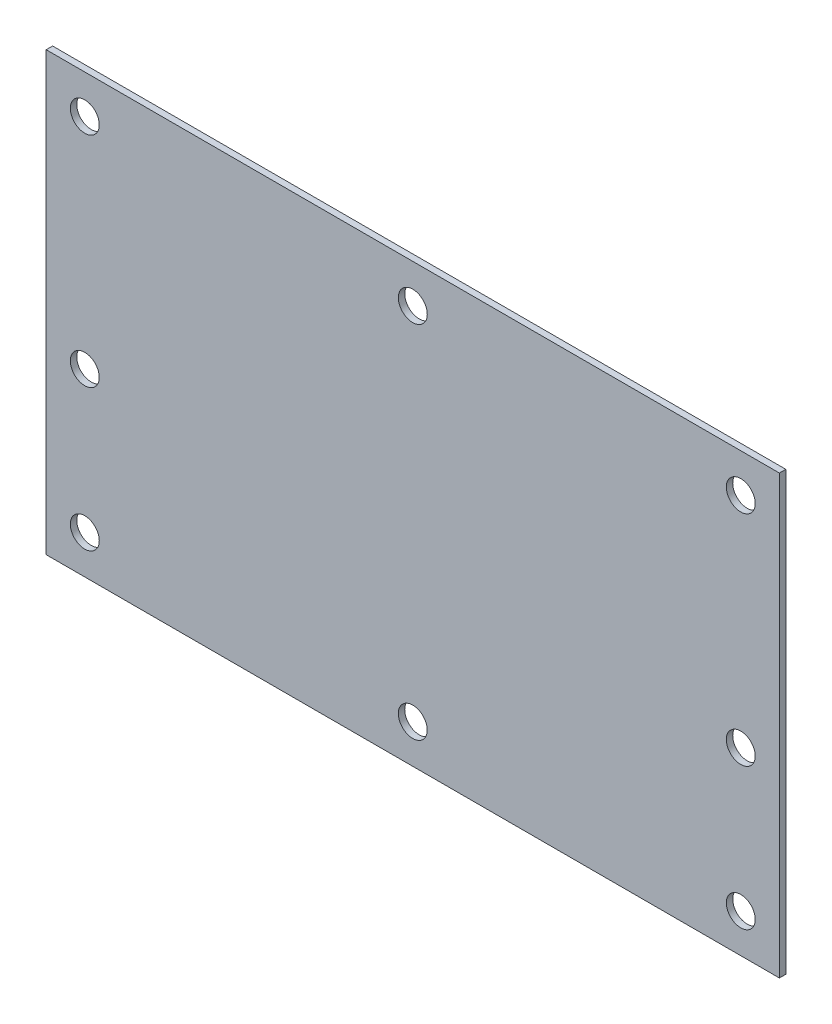
ISO-10303-21;
HEADER;
FILE_DESCRIPTION(('STEP AP214'),'2;1');
FILE_NAME('part.step','',(''),(''),'','','');
FILE_SCHEMA(('AUTOMOTIVE_DESIGN { 1 0 10303 214 1 1 1 1 }'));
ENDSEC;
DATA;
#1=APPLICATION_CONTEXT('core data for automotive mechanical design processes');
#2=APPLICATION_PROTOCOL_DEFINITION('international standard','automotive_design',2000,#1);
#3=PRODUCT_CONTEXT('',#1,'mechanical');
#4=PRODUCT('Part','Part','',(#3));
#5=PRODUCT_RELATED_PRODUCT_CATEGORY('part','',(#4));
#6=PRODUCT_DEFINITION_FORMATION('','',#4);
#7=PRODUCT_DEFINITION_CONTEXT('part definition',#1,'design');
#8=PRODUCT_DEFINITION('design','',#6,#7);
#9=PRODUCT_DEFINITION_SHAPE('','',#8);
#10=(LENGTH_UNIT() NAMED_UNIT(*) SI_UNIT(.MILLI.,.METRE.));
#11=(NAMED_UNIT(*) PLANE_ANGLE_UNIT() SI_UNIT($,.RADIAN.));
#12=(NAMED_UNIT(*) SI_UNIT($,.STERADIAN.) SOLID_ANGLE_UNIT());
#13=UNCERTAINTY_MEASURE_WITH_UNIT(LENGTH_MEASURE(1.E-05),#10,'distance_accuracy_value','');
#14=(GEOMETRIC_REPRESENTATION_CONTEXT(3) GLOBAL_UNCERTAINTY_ASSIGNED_CONTEXT((#13)) GLOBAL_UNIT_ASSIGNED_CONTEXT((#10,
#11,#12)) REPRESENTATION_CONTEXT('',''));
#15=CARTESIAN_POINT('',(0.,0.,0.));
#16=DIRECTION('',(0.,0.,1.));
#17=DIRECTION('',(1.,0.,0.));
#18=AXIS2_PLACEMENT_3D('',#15,#16,#17);
#19=CARTESIAN_POINT('',(0.,0.,1.));
#20=DIRECTION('',(1.,0.,0.));
#21=DIRECTION('',(0.,0.,-1.));
#22=AXIS2_PLACEMENT_3D('',#19,#20,#21);
#23=PLANE('',#22);
#24=DIRECTION('',(0.,-1.,0.));
#25=VECTOR('',#24,1.);
#26=CARTESIAN_POINT('',(0.,0.,0.));
#27=LINE('',#26,#25);
#28=CARTESIAN_POINT('',(0.,68.,0.));
#29=VERTEX_POINT('',#28);
#30=CARTESIAN_POINT('',(0.,0.,0.));
#31=VERTEX_POINT('',#30);
#32=EDGE_CURVE('E98',#29,#31,#27,.T.);
#33=ORIENTED_EDGE('',*,*,#32,.T.);
#34=DIRECTION('',(0.,0.,-1.));
#35=VECTOR('',#34,1.);
#36=CARTESIAN_POINT('',(0.,0.,1.));
#37=LINE('',#36,#35);
#38=CARTESIAN_POINT('',(0.,0.,1.));
#39=VERTEX_POINT('',#38);
#40=EDGE_CURVE('E11',#39,#31,#37,.T.);
#41=ORIENTED_EDGE('',*,*,#40,.F.);
#42=DIRECTION('',(0.,-1.,0.));
#43=VECTOR('',#42,1.);
#44=CARTESIAN_POINT('',(0.,0.,1.));
#45=LINE('',#44,#43);
#46=CARTESIAN_POINT('',(0.,68.,1.));
#47=VERTEX_POINT('',#46);
#48=EDGE_CURVE('E86',#47,#39,#45,.T.);
#49=ORIENTED_EDGE('',*,*,#48,.F.);
#50=DIRECTION('',(0.,0.,-1.));
#51=VECTOR('',#50,1.);
#52=CARTESIAN_POINT('',(0.,68.,1.));
#53=LINE('',#52,#51);
#54=EDGE_CURVE('E94',#47,#29,#53,.T.);
#55=ORIENTED_EDGE('',*,*,#54,.T.);
#56=EDGE_LOOP('',(#33,#41,#49,#55));
#57=FACE_BOUND('',#56,.T.);
#58=ADVANCED_FACE('F35',(#57),#23,.F.);
#59=CARTESIAN_POINT('',(0.,0.,1.));
#60=DIRECTION('',(0.,1.,0.));
#61=DIRECTION('',(0.,0.,1.));
#62=AXIS2_PLACEMENT_3D('',#59,#60,#61);
#63=PLANE('',#62);
#64=DIRECTION('',(1.,0.,0.));
#65=VECTOR('',#64,1.);
#66=CARTESIAN_POINT('',(0.,0.,0.));
#67=LINE('',#66,#65);
#68=CARTESIAN_POINT('',(114.,0.,0.));
#69=VERTEX_POINT('',#68);
#70=EDGE_CURVE('E90',#31,#69,#67,.T.);
#71=ORIENTED_EDGE('',*,*,#70,.T.);
#72=DIRECTION('',(0.,0.,-1.));
#73=VECTOR('',#72,1.);
#74=CARTESIAN_POINT('',(114.,0.,1.));
#75=LINE('',#74,#73);
#76=CARTESIAN_POINT('',(114.,0.,1.));
#77=VERTEX_POINT('',#76);
#78=EDGE_CURVE('E43',#77,#69,#75,.T.);
#79=ORIENTED_EDGE('',*,*,#78,.F.);
#80=DIRECTION('',(1.,0.,0.));
#81=VECTOR('',#80,1.);
#82=CARTESIAN_POINT('',(0.,0.,1.));
#83=LINE('',#82,#81);
#84=EDGE_CURVE('E81',#39,#77,#83,.T.);
#85=ORIENTED_EDGE('',*,*,#84,.F.);
#86=ORIENTED_EDGE('',*,*,#40,.T.);
#87=EDGE_LOOP('',(#71,#79,#85,#86));
#88=FACE_BOUND('',#87,.T.);
#89=ADVANCED_FACE('F89',(#88),#63,.F.);
#90=CARTESIAN_POINT('',(114.,0.,1.));
#91=DIRECTION('',(-1.,0.,0.));
#92=DIRECTION('',(0.,0.,1.));
#93=AXIS2_PLACEMENT_3D('',#90,#91,#92);
#94=PLANE('',#93);
#95=DIRECTION('',(0.,1.,0.));
#96=VECTOR('',#95,1.);
#97=CARTESIAN_POINT('',(114.,0.,0.));
#98=LINE('',#97,#96);
#99=CARTESIAN_POINT('',(114.,68.,0.));
#100=VERTEX_POINT('',#99);
#101=EDGE_CURVE('E68',#69,#100,#98,.T.);
#102=ORIENTED_EDGE('',*,*,#101,.T.);
#103=DIRECTION('',(0.,0.,-1.));
#104=VECTOR('',#103,1.);
#105=CARTESIAN_POINT('',(114.,68.,1.));
#106=LINE('',#105,#104);
#107=CARTESIAN_POINT('',(114.,68.,1.));
#108=VERTEX_POINT('',#107);
#109=EDGE_CURVE('E91',#108,#100,#106,.T.);
#110=ORIENTED_EDGE('',*,*,#109,.F.);
#111=DIRECTION('',(0.,1.,0.));
#112=VECTOR('',#111,1.);
#113=CARTESIAN_POINT('',(114.,0.,1.));
#114=LINE('',#113,#112);
#115=EDGE_CURVE('E84',#77,#108,#114,.T.);
#116=ORIENTED_EDGE('',*,*,#115,.F.);
#117=ORIENTED_EDGE('',*,*,#78,.T.);
#118=EDGE_LOOP('',(#102,#110,#116,#117));
#119=FACE_BOUND('',#118,.T.);
#120=ADVANCED_FACE('F92',(#119),#94,.F.);
#121=CARTESIAN_POINT('',(0.,68.,1.));
#122=DIRECTION('',(0.,-1.,0.));
#123=DIRECTION('',(0.,0.,-1.));
#124=AXIS2_PLACEMENT_3D('',#121,#122,#123);
#125=PLANE('',#124);
#126=DIRECTION('',(-1.,0.,0.));
#127=VECTOR('',#126,1.);
#128=CARTESIAN_POINT('',(0.,68.,0.));
#129=LINE('',#128,#127);
#130=EDGE_CURVE('E74',#100,#29,#129,.T.);
#131=ORIENTED_EDGE('',*,*,#130,.T.);
#132=ORIENTED_EDGE('',*,*,#54,.F.);
#133=DIRECTION('',(-1.,0.,0.));
#134=VECTOR('',#133,1.);
#135=CARTESIAN_POINT('',(0.,68.,1.));
#136=LINE('',#135,#134);
#137=EDGE_CURVE('E51',#108,#47,#136,.T.);
#138=ORIENTED_EDGE('',*,*,#137,.F.);
#139=ORIENTED_EDGE('',*,*,#109,.T.);
#140=EDGE_LOOP('',(#131,#132,#138,#139));
#141=FACE_BOUND('',#140,.T.);
#142=ADVANCED_FACE('F106',(#141),#125,.F.);
#143=CARTESIAN_POINT('',(0.,0.,1.));
#144=DIRECTION('',(0.,0.,-1.));
#145=DIRECTION('',(-1.,0.,0.));
#146=AXIS2_PLACEMENT_3D('',#143,#144,#145);
#147=PLANE('',#146);
#148=CARTESIAN_POINT('',(108.,6.,1.));
#149=DIRECTION('',(0.,0.,1.));
#150=DIRECTION('',(1.,0.,0.));
#151=AXIS2_PLACEMENT_3D('',#148,#149,#150);
#152=CIRCLE('',#151,2.25);
#153=CARTESIAN_POINT('',(110.25,6.,1.));
#154=VERTEX_POINT('',#153);
#155=EDGE_CURVE('E139',#154,#154,#152,.T.);
#156=ORIENTED_EDGE('',*,*,#155,.F.);
#157=EDGE_LOOP('',(#156));
#158=FACE_BOUND('',#157,.T.);
#159=CARTESIAN_POINT('',(108.,28.,1.));
#160=DIRECTION('',(0.,0.,1.));
#161=DIRECTION('',(1.,0.,0.));
#162=AXIS2_PLACEMENT_3D('',#159,#160,#161);
#163=CIRCLE('',#162,2.25);
#164=CARTESIAN_POINT('',(110.25,28.,1.));
#165=VERTEX_POINT('',#164);
#166=EDGE_CURVE('E145',#165,#165,#163,.T.);
#167=ORIENTED_EDGE('',*,*,#166,.F.);
#168=EDGE_LOOP('',(#167));
#169=FACE_BOUND('',#168,.T.);
#170=CARTESIAN_POINT('',(108.,62.,1.));
#171=DIRECTION('',(0.,0.,1.));
#172=DIRECTION('',(1.,0.,0.));
#173=AXIS2_PLACEMENT_3D('',#170,#171,#172);
#174=CIRCLE('',#173,2.24999999999999);
#175=CARTESIAN_POINT('',(110.25,62.,1.));
#176=VERTEX_POINT('',#175);
#177=EDGE_CURVE('E151',#176,#176,#174,.T.);
#178=ORIENTED_EDGE('',*,*,#177,.F.);
#179=EDGE_LOOP('',(#178));
#180=FACE_BOUND('',#179,.T.);
#181=CARTESIAN_POINT('',(57.,62.,1.));
#182=DIRECTION('',(0.,0.,1.));
#183=DIRECTION('',(1.,0.,0.));
#184=AXIS2_PLACEMENT_3D('',#181,#182,#183);
#185=CIRCLE('',#184,2.25);
#186=CARTESIAN_POINT('',(59.25,62.,1.));
#187=VERTEX_POINT('',#186);
#188=EDGE_CURVE('E128',#187,#187,#185,.T.);
#189=ORIENTED_EDGE('',*,*,#188,.F.);
#190=EDGE_LOOP('',(#189));
#191=FACE_BOUND('',#190,.T.);
#192=CARTESIAN_POINT('',(6.00000000000001,6.,1.));
#193=DIRECTION('',(0.,0.,1.));
#194=DIRECTION('',(1.,0.,0.));
#195=AXIS2_PLACEMENT_3D('',#192,#193,#194);
#196=CIRCLE('',#195,2.25);
#197=CARTESIAN_POINT('',(8.25000000000001,6.,1.));
#198=VERTEX_POINT('',#197);
#199=EDGE_CURVE('E115',#198,#198,#196,.T.);
#200=ORIENTED_EDGE('',*,*,#199,.F.);
#201=EDGE_LOOP('',(#200));
#202=FACE_BOUND('',#201,.T.);
#203=CARTESIAN_POINT('',(6.00000000000001,62.,1.));
#204=DIRECTION('',(0.,0.,1.));
#205=DIRECTION('',(1.,0.,0.));
#206=AXIS2_PLACEMENT_3D('',#203,#204,#205);
#207=CIRCLE('',#206,2.25);
#208=CARTESIAN_POINT('',(8.25,62.,1.));
#209=VERTEX_POINT('',#208);
#210=EDGE_CURVE('E121',#209,#209,#207,.T.);
#211=ORIENTED_EDGE('',*,*,#210,.F.);
#212=EDGE_LOOP('',(#211));
#213=FACE_BOUND('',#212,.T.);
#214=CARTESIAN_POINT('',(57.,6.,1.));
#215=DIRECTION('',(0.,0.,1.));
#216=DIRECTION('',(1.,0.,0.));
#217=AXIS2_PLACEMENT_3D('',#214,#215,#216);
#218=CIRCLE('',#217,2.25);
#219=CARTESIAN_POINT('',(59.25,6.,1.));
#220=VERTEX_POINT('',#219);
#221=EDGE_CURVE('E127',#220,#220,#218,.T.);
#222=ORIENTED_EDGE('',*,*,#221,.F.);
#223=EDGE_LOOP('',(#222));
#224=FACE_BOUND('',#223,.T.);
#225=CARTESIAN_POINT('',(6.,28.,1.));
#226=DIRECTION('',(0.,0.,1.));
#227=DIRECTION('',(1.,0.,0.));
#228=AXIS2_PLACEMENT_3D('',#225,#226,#227);
#229=CIRCLE('',#228,2.25);
#230=CARTESIAN_POINT('',(8.25000000000001,28.,1.));
#231=VERTEX_POINT('',#230);
#232=EDGE_CURVE('E101',#231,#231,#229,.T.);
#233=ORIENTED_EDGE('',*,*,#232,.F.);
#234=EDGE_LOOP('',(#233));
#235=FACE_BOUND('',#234,.T.);
#236=ORIENTED_EDGE('',*,*,#48,.T.);
#237=ORIENTED_EDGE('',*,*,#84,.T.);
#238=ORIENTED_EDGE('',*,*,#115,.T.);
#239=ORIENTED_EDGE('',*,*,#137,.T.);
#240=EDGE_LOOP('',(#236,#237,#238,#239));
#241=FACE_BOUND('',#240,.T.);
#242=ADVANCED_FACE('F82',(#158,#169,#180,#191,#202,#213,#224,#235,#241),#147,.F.);
#243=CARTESIAN_POINT('',(0.,0.,0.));
#244=DIRECTION('',(0.,0.,-1.));
#245=DIRECTION('',(-1.,0.,0.));
#246=AXIS2_PLACEMENT_3D('',#243,#244,#245);
#247=PLANE('',#246);
#248=CARTESIAN_POINT('',(108.,6.,0.));
#249=DIRECTION('',(0.,0.,-1.));
#250=DIRECTION('',(-1.,0.,0.));
#251=AXIS2_PLACEMENT_3D('',#248,#249,#250);
#252=CIRCLE('',#251,2.25);
#253=CARTESIAN_POINT('',(105.75,6.,0.));
#254=VERTEX_POINT('',#253);
#255=EDGE_CURVE('E136',#254,#254,#252,.F.);
#256=ORIENTED_EDGE('',*,*,#255,.T.);
#257=EDGE_LOOP('',(#256));
#258=FACE_BOUND('',#257,.T.);
#259=CARTESIAN_POINT('',(108.,28.,0.));
#260=DIRECTION('',(0.,0.,-1.));
#261=DIRECTION('',(-1.,0.,0.));
#262=AXIS2_PLACEMENT_3D('',#259,#260,#261);
#263=CIRCLE('',#262,2.25);
#264=CARTESIAN_POINT('',(105.75,28.,0.));
#265=VERTEX_POINT('',#264);
#266=EDGE_CURVE('E142',#265,#265,#263,.F.);
#267=ORIENTED_EDGE('',*,*,#266,.T.);
#268=EDGE_LOOP('',(#267));
#269=FACE_BOUND('',#268,.T.);
#270=CARTESIAN_POINT('',(108.,62.,0.));
#271=DIRECTION('',(0.,0.,-1.));
#272=DIRECTION('',(-1.,0.,0.));
#273=AXIS2_PLACEMENT_3D('',#270,#271,#272);
#274=CIRCLE('',#273,2.24999999999999);
#275=CARTESIAN_POINT('',(105.75,62.,0.));
#276=VERTEX_POINT('',#275);
#277=EDGE_CURVE('E148',#276,#276,#274,.F.);
#278=ORIENTED_EDGE('',*,*,#277,.T.);
#279=EDGE_LOOP('',(#278));
#280=FACE_BOUND('',#279,.T.);
#281=CARTESIAN_POINT('',(57.,62.,0.));
#282=DIRECTION('',(0.,0.,-1.));
#283=DIRECTION('',(-1.,0.,0.));
#284=AXIS2_PLACEMENT_3D('',#281,#282,#283);
#285=CIRCLE('',#284,2.25);
#286=CARTESIAN_POINT('',(54.75,62.,0.));
#287=VERTEX_POINT('',#286);
#288=EDGE_CURVE('E154',#287,#287,#285,.F.);
#289=ORIENTED_EDGE('',*,*,#288,.T.);
#290=EDGE_LOOP('',(#289));
#291=FACE_BOUND('',#290,.T.);
#292=CARTESIAN_POINT('',(6.00000000000001,6.,0.));
#293=DIRECTION('',(0.,0.,-1.));
#294=DIRECTION('',(-1.,0.,0.));
#295=AXIS2_PLACEMENT_3D('',#292,#293,#294);
#296=CIRCLE('',#295,2.25);
#297=CARTESIAN_POINT('',(3.75000000000001,6.,0.));
#298=VERTEX_POINT('',#297);
#299=EDGE_CURVE('E118',#298,#298,#296,.F.);
#300=ORIENTED_EDGE('',*,*,#299,.T.);
#301=EDGE_LOOP('',(#300));
#302=FACE_BOUND('',#301,.T.);
#303=CARTESIAN_POINT('',(6.00000000000001,62.,0.));
#304=DIRECTION('',(0.,0.,-1.));
#305=DIRECTION('',(-1.,0.,0.));
#306=AXIS2_PLACEMENT_3D('',#303,#304,#305);
#307=CIRCLE('',#306,2.25);
#308=CARTESIAN_POINT('',(3.75000000000001,62.,0.));
#309=VERTEX_POINT('',#308);
#310=EDGE_CURVE('E131',#309,#309,#307,.F.);
#311=ORIENTED_EDGE('',*,*,#310,.T.);
#312=EDGE_LOOP('',(#311));
#313=FACE_BOUND('',#312,.T.);
#314=CARTESIAN_POINT('',(57.,6.,0.));
#315=DIRECTION('',(0.,0.,-1.));
#316=DIRECTION('',(-1.,0.,0.));
#317=AXIS2_PLACEMENT_3D('',#314,#315,#316);
#318=CIRCLE('',#317,2.25);
#319=CARTESIAN_POINT('',(54.75,6.,0.));
#320=VERTEX_POINT('',#319);
#321=EDGE_CURVE('E124',#320,#320,#318,.F.);
#322=ORIENTED_EDGE('',*,*,#321,.T.);
#323=EDGE_LOOP('',(#322));
#324=FACE_BOUND('',#323,.T.);
#325=CARTESIAN_POINT('',(6.,28.,0.));
#326=DIRECTION('',(0.,0.,-1.));
#327=DIRECTION('',(-1.,0.,0.));
#328=AXIS2_PLACEMENT_3D('',#325,#326,#327);
#329=CIRCLE('',#328,2.25);
#330=CARTESIAN_POINT('',(3.75,28.,0.));
#331=VERTEX_POINT('',#330);
#332=EDGE_CURVE('E112',#331,#331,#329,.F.);
#333=ORIENTED_EDGE('',*,*,#332,.T.);
#334=EDGE_LOOP('',(#333));
#335=FACE_BOUND('',#334,.T.);
#336=ORIENTED_EDGE('',*,*,#32,.F.);
#337=ORIENTED_EDGE('',*,*,#130,.F.);
#338=ORIENTED_EDGE('',*,*,#101,.F.);
#339=ORIENTED_EDGE('',*,*,#70,.F.);
#340=EDGE_LOOP('',(#336,#337,#338,#339));
#341=FACE_BOUND('',#340,.T.);
#342=ADVANCED_FACE('F109',(#258,#269,#280,#291,#302,#313,#324,#335,#341),#247,.T.);
#343=CARTESIAN_POINT('',(6.,28.,-0.000999999999999916));
#344=DIRECTION('',(0.,0.,1.));
#345=DIRECTION('',(1.,0.,0.));
#346=AXIS2_PLACEMENT_3D('',#343,#344,#345);
#347=CYLINDRICAL_SURFACE('',#346,2.25);
#348=ORIENTED_EDGE('',*,*,#332,.F.);
#349=EDGE_LOOP('',(#348));
#350=FACE_BOUND('',#349,.T.);
#351=ORIENTED_EDGE('',*,*,#232,.T.);
#352=EDGE_LOOP('',(#351));
#353=FACE_BOUND('',#352,.T.);
#354=ADVANCED_FACE('F174',(#350,#353),#347,.F.);
#355=CARTESIAN_POINT('',(57.,6.,-0.000999999999999916));
#356=DIRECTION('',(0.,0.,1.));
#357=DIRECTION('',(1.,0.,0.));
#358=AXIS2_PLACEMENT_3D('',#355,#356,#357);
#359=CYLINDRICAL_SURFACE('',#358,2.25);
#360=ORIENTED_EDGE('',*,*,#321,.F.);
#361=EDGE_LOOP('',(#360));
#362=FACE_BOUND('',#361,.T.);
#363=ORIENTED_EDGE('',*,*,#221,.T.);
#364=EDGE_LOOP('',(#363));
#365=FACE_BOUND('',#364,.T.);
#366=ADVANCED_FACE('F176',(#362,#365),#359,.F.);
#367=CARTESIAN_POINT('',(6.00000000000001,62.,-0.000999999999999916));
#368=DIRECTION('',(0.,0.,1.));
#369=DIRECTION('',(1.,0.,0.));
#370=AXIS2_PLACEMENT_3D('',#367,#368,#369);
#371=CYLINDRICAL_SURFACE('',#370,2.25);
#372=ORIENTED_EDGE('',*,*,#310,.F.);
#373=EDGE_LOOP('',(#372));
#374=FACE_BOUND('',#373,.T.);
#375=ORIENTED_EDGE('',*,*,#210,.T.);
#376=EDGE_LOOP('',(#375));
#377=FACE_BOUND('',#376,.T.);
#378=ADVANCED_FACE('F183',(#374,#377),#371,.F.);
#379=CARTESIAN_POINT('',(6.00000000000001,6.,-0.000999999999999916));
#380=DIRECTION('',(0.,0.,1.));
#381=DIRECTION('',(1.,0.,0.));
#382=AXIS2_PLACEMENT_3D('',#379,#380,#381);
#383=CYLINDRICAL_SURFACE('',#382,2.25);
#384=ORIENTED_EDGE('',*,*,#299,.F.);
#385=EDGE_LOOP('',(#384));
#386=FACE_BOUND('',#385,.T.);
#387=ORIENTED_EDGE('',*,*,#199,.T.);
#388=EDGE_LOOP('',(#387));
#389=FACE_BOUND('',#388,.T.);
#390=ADVANCED_FACE('F231',(#386,#389),#383,.F.);
#391=CARTESIAN_POINT('',(57.,62.,-0.000999999999999916));
#392=DIRECTION('',(0.,0.,1.));
#393=DIRECTION('',(1.,0.,0.));
#394=AXIS2_PLACEMENT_3D('',#391,#392,#393);
#395=CYLINDRICAL_SURFACE('',#394,2.25);
#396=ORIENTED_EDGE('',*,*,#288,.F.);
#397=EDGE_LOOP('',(#396));
#398=FACE_BOUND('',#397,.T.);
#399=ORIENTED_EDGE('',*,*,#188,.T.);
#400=EDGE_LOOP('',(#399));
#401=FACE_BOUND('',#400,.T.);
#402=ADVANCED_FACE('F160',(#398,#401),#395,.F.);
#403=CARTESIAN_POINT('',(108.,62.,-0.000999999999999916));
#404=DIRECTION('',(0.,0.,1.));
#405=DIRECTION('',(1.,0.,0.));
#406=AXIS2_PLACEMENT_3D('',#403,#404,#405);
#407=CYLINDRICAL_SURFACE('',#406,2.24999999999999);
#408=ORIENTED_EDGE('',*,*,#277,.F.);
#409=EDGE_LOOP('',(#408));
#410=FACE_BOUND('',#409,.T.);
#411=ORIENTED_EDGE('',*,*,#177,.T.);
#412=EDGE_LOOP('',(#411));
#413=FACE_BOUND('',#412,.T.);
#414=ADVANCED_FACE('F249',(#410,#413),#407,.F.);
#415=CARTESIAN_POINT('',(108.,28.,-0.000999999999999916));
#416=DIRECTION('',(0.,0.,1.));
#417=DIRECTION('',(1.,0.,0.));
#418=AXIS2_PLACEMENT_3D('',#415,#416,#417);
#419=CYLINDRICAL_SURFACE('',#418,2.25);
#420=ORIENTED_EDGE('',*,*,#266,.F.);
#421=EDGE_LOOP('',(#420));
#422=FACE_BOUND('',#421,.T.);
#423=ORIENTED_EDGE('',*,*,#166,.T.);
#424=EDGE_LOOP('',(#423));
#425=FACE_BOUND('',#424,.T.);
#426=ADVANCED_FACE('F259',(#422,#425),#419,.F.);
#427=CARTESIAN_POINT('',(108.,6.,-0.000999999999999916));
#428=DIRECTION('',(0.,0.,1.));
#429=DIRECTION('',(1.,0.,0.));
#430=AXIS2_PLACEMENT_3D('',#427,#428,#429);
#431=CYLINDRICAL_SURFACE('',#430,2.25);
#432=ORIENTED_EDGE('',*,*,#255,.F.);
#433=EDGE_LOOP('',(#432));
#434=FACE_BOUND('',#433,.T.);
#435=ORIENTED_EDGE('',*,*,#155,.T.);
#436=EDGE_LOOP('',(#435));
#437=FACE_BOUND('',#436,.T.);
#438=ADVANCED_FACE('F269',(#434,#437),#431,.F.);
#439=CLOSED_SHELL('',(#58,#89,#120,#142,#242,#342,#354,#366,#378,#390,#402,#414,#426,#438));
#440=MANIFOLD_SOLID_BREP('B2',#439);
#441=ADVANCED_BREP_SHAPE_REPRESENTATION('',(#18,#440),#14);
#442=SHAPE_DEFINITION_REPRESENTATION(#9,#441);
ENDSEC;
END-ISO-10303-21;
